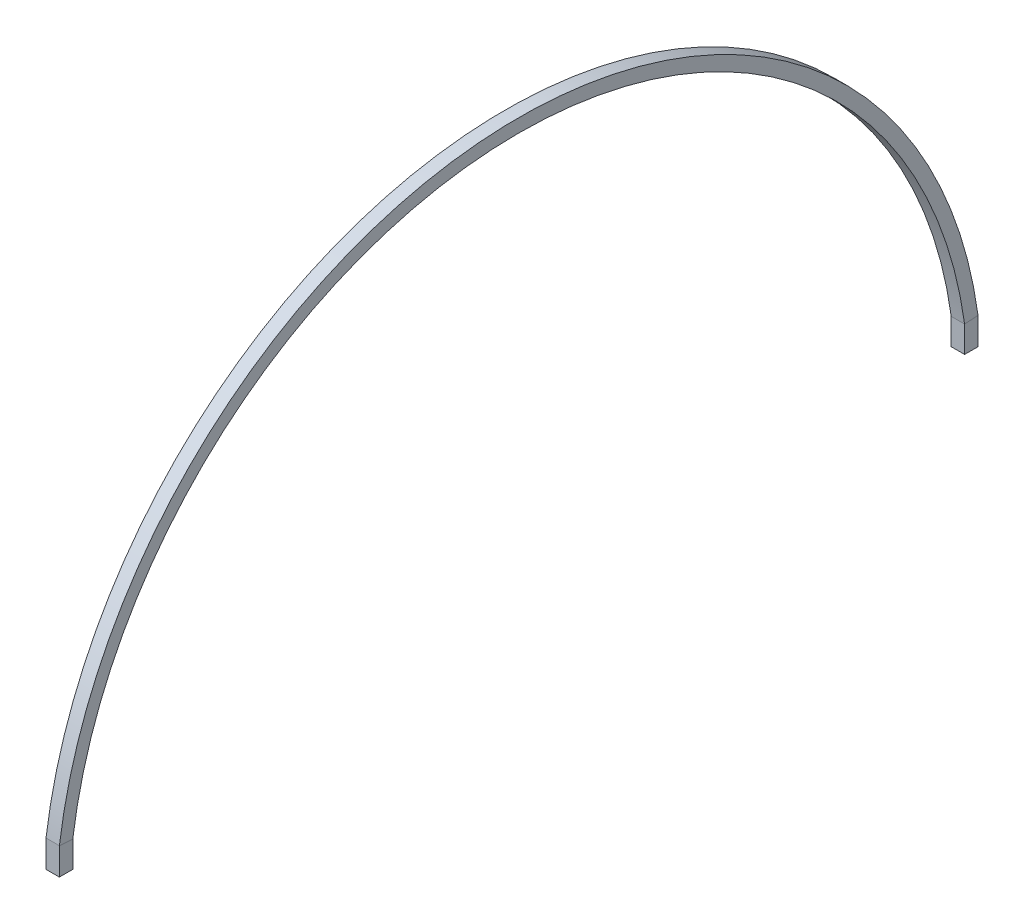
ISO-10303-21;
HEADER;
FILE_DESCRIPTION(('STEP AP214'),'2;1');
FILE_NAME('part.step','',(''),(''),'','','');
FILE_SCHEMA(('AUTOMOTIVE_DESIGN { 1 0 10303 214 1 1 1 1 }'));
ENDSEC;
DATA;
#1=APPLICATION_CONTEXT('core data for automotive mechanical design processes');
#2=APPLICATION_PROTOCOL_DEFINITION('international standard','automotive_design',2000,#1);
#3=PRODUCT_CONTEXT('',#1,'mechanical');
#4=PRODUCT('Part','Part','',(#3));
#5=PRODUCT_RELATED_PRODUCT_CATEGORY('part','',(#4));
#6=PRODUCT_DEFINITION_FORMATION('','',#4);
#7=PRODUCT_DEFINITION_CONTEXT('part definition',#1,'design');
#8=PRODUCT_DEFINITION('design','',#6,#7);
#9=PRODUCT_DEFINITION_SHAPE('','',#8);
#10=(LENGTH_UNIT() NAMED_UNIT(*) SI_UNIT(.MILLI.,.METRE.));
#11=(NAMED_UNIT(*) PLANE_ANGLE_UNIT() SI_UNIT($,.RADIAN.));
#12=(NAMED_UNIT(*) SI_UNIT($,.STERADIAN.) SOLID_ANGLE_UNIT());
#13=UNCERTAINTY_MEASURE_WITH_UNIT(LENGTH_MEASURE(1.E-05),#10,'distance_accuracy_value','');
#14=(GEOMETRIC_REPRESENTATION_CONTEXT(3) GLOBAL_UNCERTAINTY_ASSIGNED_CONTEXT((#13)) GLOBAL_UNIT_ASSIGNED_CONTEXT((#10,
#11,#12)) REPRESENTATION_CONTEXT('',''));
#15=CARTESIAN_POINT('',(0.,0.,0.));
#16=DIRECTION('',(0.,0.,1.));
#17=DIRECTION('',(1.,0.,0.));
#18=AXIS2_PLACEMENT_3D('',#15,#16,#17);
#19=CARTESIAN_POINT('',(-13.0000000000001,1.07842105263029,0.));
#20=DIRECTION('',(-1.,0.,0.));
#21=DIRECTION('',(0.,0.,1.));
#22=AXIS2_PLACEMENT_3D('',#19,#20,#21);
#23=PLANE('',#22);
#24=DIRECTION('',(0.,0.0683704216386458,0.997660004934022));
#25=VECTOR('',#24,1.);
#26=CARTESIAN_POINT('',(-13.0000000000003,-0.892326633343182,1002.));
#27=LINE('',#26,#25);
#28=CARTESIAN_POINT('',(-13.,-0.892326633343182,1002.));
#29=VERTEX_POINT('',#28);
#30=CARTESIAN_POINT('',(-13.,0.889473733100005,1027.99999999833));
#31=VERTEX_POINT('',#30);
#32=EDGE_CURVE('E161',#29,#31,#27,.T.);
#33=ORIENTED_EDGE('',*,*,#32,.T.);
#34=DIRECTION('',(0.,-1.,0.));
#35=VECTOR('',#34,1.);
#36=CARTESIAN_POINT('',(-13.,1.07842105263029,1028.));
#37=LINE('',#36,#35);
#38=CARTESIAN_POINT('',(-13.,-60.,1028.));
#39=VERTEX_POINT('',#38);
#40=EDGE_CURVE('E229',#31,#39,#37,.T.);
#41=ORIENTED_EDGE('',*,*,#40,.T.);
#42=DIRECTION('',(0.,0.,1.));
#43=VECTOR('',#42,1.);
#44=CARTESIAN_POINT('',(-13.0000000000001,-60.,0.));
#45=LINE('',#44,#43);
#46=CARTESIAN_POINT('',(-13.,-60.,1002.));
#47=VERTEX_POINT('',#46);
#48=EDGE_CURVE('E234',#47,#39,#45,.T.);
#49=ORIENTED_EDGE('',*,*,#48,.F.);
#50=DIRECTION('',(0.,-1.,0.));
#51=VECTOR('',#50,1.);
#52=CARTESIAN_POINT('',(-13.,1.07842105263029,1002.));
#53=LINE('',#52,#51);
#54=EDGE_CURVE('E189',#29,#47,#53,.T.);
#55=ORIENTED_EDGE('',*,*,#54,.F.);
#56=EDGE_LOOP('',(#33,#41,#49,#55));
#57=FACE_BOUND('',#56,.T.);
#58=ADVANCED_FACE('F40',(#57),#23,.F.);
#59=CARTESIAN_POINT('',(0.,1.07842105263029,1002.));
#60=DIRECTION('',(0.,0.,-1.));
#61=DIRECTION('',(-1.,0.,0.));
#62=AXIS2_PLACEMENT_3D('',#59,#60,#61);
#63=PLANE('',#62);
#64=ORIENTED_EDGE('',*,*,#54,.T.);
#65=DIRECTION('',(1.,0.,0.));
#66=VECTOR('',#65,1.);
#67=CARTESIAN_POINT('',(0.,-60.,1002.));
#68=LINE('',#67,#66);
#69=CARTESIAN_POINT('',(12.9999999999999,-60.,1002.));
#70=VERTEX_POINT('',#69);
#71=EDGE_CURVE('E185',#47,#70,#68,.T.);
#72=ORIENTED_EDGE('',*,*,#71,.T.);
#73=DIRECTION('',(0.,-1.,0.));
#74=VECTOR('',#73,1.);
#75=CARTESIAN_POINT('',(12.9999999999999,1.07842105263029,1002.));
#76=LINE('',#75,#74);
#77=CARTESIAN_POINT('',(12.9999999999999,-0.892326633343182,1002.));
#78=VERTEX_POINT('',#77);
#79=EDGE_CURVE('E44',#78,#70,#76,.T.);
#80=ORIENTED_EDGE('',*,*,#79,.F.);
#81=DIRECTION('',(1.,0.,0.));
#82=VECTOR('',#81,1.);
#83=CARTESIAN_POINT('',(0.,-0.892326633343182,1002.));
#84=LINE('',#83,#82);
#85=EDGE_CURVE('E168',#29,#78,#84,.T.);
#86=ORIENTED_EDGE('',*,*,#85,.F.);
#87=EDGE_LOOP('',(#64,#72,#80,#86));
#88=FACE_BOUND('',#87,.T.);
#89=ADVANCED_FACE('F184',(#88),#63,.F.);
#90=CARTESIAN_POINT('',(12.9999999999999,1.07842105263029,0.));
#91=DIRECTION('',(1.,0.,0.));
#92=DIRECTION('',(0.,0.,-1.));
#93=AXIS2_PLACEMENT_3D('',#90,#91,#92);
#94=PLANE('',#93);
#95=DIRECTION('',(0.,-0.0683704216386464,-0.997660004934022));
#96=VECTOR('',#95,1.);
#97=CARTESIAN_POINT('',(12.9999999999997,0.889473733100017,1027.99999999667));
#98=LINE('',#97,#96);
#99=CARTESIAN_POINT('',(13.,0.889473733100013,1027.99999999834));
#100=VERTEX_POINT('',#99);
#101=EDGE_CURVE('E178',#100,#78,#98,.T.);
#102=ORIENTED_EDGE('',*,*,#101,.T.);
#103=ORIENTED_EDGE('',*,*,#79,.T.);
#104=DIRECTION('',(0.,0.,1.));
#105=VECTOR('',#104,1.);
#106=CARTESIAN_POINT('',(12.9999999999999,-60.,0.));
#107=LINE('',#106,#105);
#108=CARTESIAN_POINT('',(13.,-60.,1028.));
#109=VERTEX_POINT('',#108);
#110=EDGE_CURVE('E240',#70,#109,#107,.T.);
#111=ORIENTED_EDGE('',*,*,#110,.T.);
#112=DIRECTION('',(0.,-1.,0.));
#113=VECTOR('',#112,1.);
#114=CARTESIAN_POINT('',(13.,1.07842105263029,1028.));
#115=LINE('',#114,#113);
#116=EDGE_CURVE('E192',#100,#109,#115,.T.);
#117=ORIENTED_EDGE('',*,*,#116,.F.);
#118=EDGE_LOOP('',(#102,#103,#111,#117));
#119=FACE_BOUND('',#118,.T.);
#120=ADVANCED_FACE('F42',(#119),#94,.F.);
#121=CARTESIAN_POINT('',(0.,1.07842105263029,1028.));
#122=DIRECTION('',(0.,0.,1.));
#123=DIRECTION('',(1.,0.,0.));
#124=AXIS2_PLACEMENT_3D('',#121,#122,#123);
#125=PLANE('',#124);
#126=DIRECTION('',(-1.,0.,0.));
#127=VECTOR('',#126,1.);
#128=CARTESIAN_POINT('',(0.,0.889473733557763,1028.));
#129=LINE('',#128,#127);
#130=EDGE_CURVE('E179',#31,#100,#129,.F.);
#131=ORIENTED_EDGE('',*,*,#130,.T.);
#132=ORIENTED_EDGE('',*,*,#116,.T.);
#133=DIRECTION('',(1.,0.,0.));
#134=VECTOR('',#133,1.);
#135=CARTESIAN_POINT('',(0.,-60.,1028.));
#136=LINE('',#135,#134);
#137=EDGE_CURVE('E238',#39,#109,#136,.T.);
#138=ORIENTED_EDGE('',*,*,#137,.F.);
#139=ORIENTED_EDGE('',*,*,#40,.F.);
#140=EDGE_LOOP('',(#131,#132,#138,#139));
#141=FACE_BOUND('',#140,.T.);
#142=ADVANCED_FACE('F321',(#141),#125,.F.);
#143=CARTESIAN_POINT('',(0.,-139.54802259887,-1.11022302462516E-13));
#144=DIRECTION('',(1.,0.,0.));
#145=DIRECTION('',(0.,0.,-1.));
#146=AXIS2_PLACEMENT_3D('',#143,#144,#145);
#147=CYLINDRICAL_SURFACE('',#146,1011.54802259887);
#148=ORIENTED_EDGE('',*,*,#85,.T.);
#149=CARTESIAN_POINT('',(12.9999999999999,-139.54802259887,-1.11022302462516E-13));
#150=DIRECTION('',(1.,0.,0.));
#151=DIRECTION('',(0.,0.136204472138742,-0.990680746643139));
#152=AXIS2_PLACEMENT_3D('',#149,#150,#151);
#153=CIRCLE('',#152,1011.54802259887);
#154=CARTESIAN_POINT('',(12.9999999999999,-0.89232663333999,-1002.));
#155=VERTEX_POINT('',#154);
#156=EDGE_CURVE('E173',#155,#78,#153,.T.);
#157=ORIENTED_EDGE('',*,*,#156,.F.);
#158=DIRECTION('',(1.,0.,0.));
#159=VECTOR('',#158,1.);
#160=CARTESIAN_POINT('',(0.,-0.89232663333999,-1002.));
#161=LINE('',#160,#159);
#162=CARTESIAN_POINT('',(-13.,-0.89232663333999,-1002.));
#163=VERTEX_POINT('',#162);
#164=EDGE_CURVE('E258',#163,#155,#161,.T.);
#165=ORIENTED_EDGE('',*,*,#164,.F.);
#166=CARTESIAN_POINT('',(-13.,-139.54802259887,-1.11022302462516E-13));
#167=DIRECTION('',(1.,0.,0.));
#168=DIRECTION('',(0.,0.136204472138742,-0.990680746643139));
#169=AXIS2_PLACEMENT_3D('',#166,#167,#168);
#170=CIRCLE('',#169,1011.54802259887);
#171=EDGE_CURVE('E175',#163,#29,#170,.T.);
#172=ORIENTED_EDGE('',*,*,#171,.T.);
#173=EDGE_LOOP('',(#148,#157,#165,#172));
#174=FACE_BOUND('',#173,.T.);
#175=ADVANCED_FACE('F170',(#174),#147,.T.);
#176=CARTESIAN_POINT('',(13.,0.702287164188714,-1028.02573547658));
#177=CARTESIAN_POINT('',(13.,1.06010770561768,-1027.97654025581));
#178=CARTESIAN_POINT('',(13.,1.41227515065792,-1027.92812234497));
#179=CARTESIAN_POINT('',(13.,3.67811436755165,-1027.61660120449));
#180=CARTESIAN_POINT('',(13.,5.60887975086146,-1027.34567061837));
#181=CARTESIAN_POINT('',(13.,9.44481836487751,-1026.79637055208));
#182=CARTESIAN_POINT('',(13.,11.362016770412,-1026.51634825997));
#183=CARTESIAN_POINT('',(13.,17.111210067065,-1025.66017770501));
#184=CARTESIAN_POINT('',(13.,20.9408030600636,-1025.06792559827));
#185=CARTESIAN_POINT('',(13.,32.4192597341004,-1023.22686497892));
#186=CARTESIAN_POINT('',(13.,40.0578012300402,-1021.91374942824));
#187=CARTESIAN_POINT('',(13.,62.9264102432095,-1017.71816302121));
#188=CARTESIAN_POINT('',(13.,78.1094562823739,-1014.57940879503));
#189=CARTESIAN_POINT('',(13.,123.424759267774,-1004.14751799048));
#190=CARTESIAN_POINT('',(13.,153.322845625887,-995.83812745659));
#191=CARTESIAN_POINT('',(13.,241.721967702922,-966.945284438361));
#192=CARTESIAN_POINT('',(13.,298.92254507369,-942.387154991024));
#193=CARTESIAN_POINT('',(13.,408.029862408457,-883.463891990328));
#194=CARTESIAN_POINT('',(13.,459.934727079541,-849.09977119274));
#195=CARTESIAN_POINT('',(13.,556.786749743985,-771.665648730194));
#196=CARTESIAN_POINT('',(13.,601.732243088672,-728.596977962863));
#197=CARTESIAN_POINT('',(13.,683.224662833493,-635.133920304247));
#198=CARTESIAN_POINT('',(13.,719.770188528913,-584.741139850137));
#199=CARTESIAN_POINT('',(13.,783.291004191017,-478.244831897825));
#200=CARTESIAN_POINT('',(13.,810.265202326405,-422.143134924156));
#201=CARTESIAN_POINT('',(13.,853.778439958984,-306.027004345003));
#202=CARTESIAN_POINT('',(13.,870.316731537883,-246.014566601368));
#203=CARTESIAN_POINT('',(13.,892.427701553305,-124.000376361944));
#204=CARTESIAN_POINT('',(13.,898.,-62.0007210182265));
#205=CARTESIAN_POINT('',(13.,898.,62.0007210182268));
#206=CARTESIAN_POINT('',(13.,892.427701565096,124.000376344708));
#207=CARTESIAN_POINT('',(13.,870.316731526092,246.014566618605));
#208=CARTESIAN_POINT('',(13.,853.778439955434,306.027004354474));
#209=CARTESIAN_POINT('',(13.,810.265202329954,422.143134914685));
#210=CARTESIAN_POINT('',(13.,783.291004185836,478.244831903113));
#211=CARTESIAN_POINT('',(13.,719.770188534094,584.741139844849));
#212=CARTESIAN_POINT('',(13.,683.224662830244,635.133920294877));
#213=CARTESIAN_POINT('',(13.,601.73224309192,728.596977972232));
#214=CARTESIAN_POINT('',(13.,556.786749759875,771.665648716119));
#215=CARTESIAN_POINT('',(13.,459.93472706365,849.099771206816));
#216=CARTESIAN_POINT('',(13.,408.029862393872,883.46389200473));
#217=CARTESIAN_POINT('',(13.,298.922545088273,942.387154976623));
#218=CARTESIAN_POINT('',(13.,241.721967684915,966.945284444313));
#219=CARTESIAN_POINT('',(13.,153.322845634891,995.838127453614));
#220=CARTESIAN_POINT('',(13.,123.424759267779,1004.14751798407));
#221=CARTESIAN_POINT('',(13.,78.1094562823712,1014.57940879824));
#222=CARTESIAN_POINT('',(13.,62.9264102443576,1017.71816302096));
#223=CARTESIAN_POINT('',(13.,40.0578012294668,1021.91374942836));
#224=CARTESIAN_POINT('',(13.,32.4192597337226,1023.22686497894));
#225=CARTESIAN_POINT('',(13.,20.9408030602531,1025.06792559826));
#226=CARTESIAN_POINT('',(13.,17.1112100666136,1025.66017770635));
#227=CARTESIAN_POINT('',(13.,11.3620167706383,1026.5163482593));
#228=CARTESIAN_POINT('',(13.,9.44481836548402,1026.79637055191));
#229=CARTESIAN_POINT('',(13.,5.60887975025488,1027.34567061854));
#230=CARTESIAN_POINT('',(13.,3.67811436809074,1027.61660120429));
#231=CARTESIAN_POINT('',(13.,1.41227515055514,1027.92812234501));
#232=CARTESIAN_POINT('',(13.,1.060107705703,1027.97654025588));
#233=CARTESIAN_POINT('',(13.,0.702287164185605,1028.02573547658));
#234=CARTESIAN_POINT('',(-13.,0.702287164188714,-1028.02573547658));
#235=CARTESIAN_POINT('',(-13.,1.06010770561768,-1027.97654025581));
#236=CARTESIAN_POINT('',(-13.,1.41227515065792,-1027.92812234497));
#237=CARTESIAN_POINT('',(-13.,3.67811436755165,-1027.61660120449));
#238=CARTESIAN_POINT('',(-13.,5.60887975086146,-1027.34567061837));
#239=CARTESIAN_POINT('',(-13.,9.44481836487751,-1026.79637055208));
#240=CARTESIAN_POINT('',(-13.,11.362016770412,-1026.51634825997));
#241=CARTESIAN_POINT('',(-13.,17.111210067065,-1025.66017770501));
#242=CARTESIAN_POINT('',(-13.,20.9408030600636,-1025.06792559827));
#243=CARTESIAN_POINT('',(-13.,32.4192597341004,-1023.22686497892));
#244=CARTESIAN_POINT('',(-13.,40.0578012300402,-1021.91374942824));
#245=CARTESIAN_POINT('',(-13.,62.9264102432095,-1017.71816302121));
#246=CARTESIAN_POINT('',(-13.,78.1094562823739,-1014.57940879503));
#247=CARTESIAN_POINT('',(-13.,123.424759267774,-1004.14751799048));
#248=CARTESIAN_POINT('',(-13.,153.322845625887,-995.83812745659));
#249=CARTESIAN_POINT('',(-13.,241.721967702922,-966.945284438361));
#250=CARTESIAN_POINT('',(-13.,298.92254507369,-942.387154991024));
#251=CARTESIAN_POINT('',(-13.,408.029862408457,-883.463891990328));
#252=CARTESIAN_POINT('',(-13.,459.934727079541,-849.09977119274));
#253=CARTESIAN_POINT('',(-13.,556.786749743985,-771.665648730194));
#254=CARTESIAN_POINT('',(-13.,601.732243088672,-728.596977962863));
#255=CARTESIAN_POINT('',(-13.,683.224662833493,-635.133920304247));
#256=CARTESIAN_POINT('',(-13.,719.770188528913,-584.741139850137));
#257=CARTESIAN_POINT('',(-13.,783.291004191017,-478.244831897825));
#258=CARTESIAN_POINT('',(-13.,810.265202326405,-422.143134924156));
#259=CARTESIAN_POINT('',(-13.,853.778439958984,-306.027004345003));
#260=CARTESIAN_POINT('',(-13.,870.316731537883,-246.014566601368));
#261=CARTESIAN_POINT('',(-13.,892.427701553305,-124.000376361944));
#262=CARTESIAN_POINT('',(-13.,898.,-62.0007210182265));
#263=CARTESIAN_POINT('',(-13.,898.,62.0007210182268));
#264=CARTESIAN_POINT('',(-13.,892.427701565096,124.000376344708));
#265=CARTESIAN_POINT('',(-13.,870.316731526092,246.014566618605));
#266=CARTESIAN_POINT('',(-13.,853.778439955434,306.027004354474));
#267=CARTESIAN_POINT('',(-13.,810.265202329954,422.143134914685));
#268=CARTESIAN_POINT('',(-13.,783.291004185836,478.244831903113));
#269=CARTESIAN_POINT('',(-13.,719.770188534094,584.741139844849));
#270=CARTESIAN_POINT('',(-13.,683.224662830244,635.133920294877));
#271=CARTESIAN_POINT('',(-13.,601.73224309192,728.596977972232));
#272=CARTESIAN_POINT('',(-13.,556.786749759875,771.665648716119));
#273=CARTESIAN_POINT('',(-13.,459.93472706365,849.099771206816));
#274=CARTESIAN_POINT('',(-13.,408.029862393872,883.46389200473));
#275=CARTESIAN_POINT('',(-13.,298.922545088273,942.387154976623));
#276=CARTESIAN_POINT('',(-13.,241.721967684915,966.945284444313));
#277=CARTESIAN_POINT('',(-13.,153.322845634891,995.838127453614));
#278=CARTESIAN_POINT('',(-13.,123.424759267779,1004.14751798407));
#279=CARTESIAN_POINT('',(-13.,78.1094562823712,1014.57940879824));
#280=CARTESIAN_POINT('',(-13.,62.9264102443576,1017.71816302096));
#281=CARTESIAN_POINT('',(-13.,40.0578012294668,1021.91374942836));
#282=CARTESIAN_POINT('',(-13.,32.4192597337226,1023.22686497894));
#283=CARTESIAN_POINT('',(-13.,20.9408030602531,1025.06792559826));
#284=CARTESIAN_POINT('',(-13.,17.1112100666136,1025.66017770635));
#285=CARTESIAN_POINT('',(-13.,11.3620167706383,1026.5163482593));
#286=CARTESIAN_POINT('',(-13.,9.44481836548402,1026.79637055191));
#287=CARTESIAN_POINT('',(-13.,5.60887975025488,1027.34567061854));
#288=CARTESIAN_POINT('',(-13.,3.67811436809074,1027.61660120429));
#289=CARTESIAN_POINT('',(-13.,1.41227515055514,1027.92812234501));
#290=CARTESIAN_POINT('',(-13.,1.060107705703,1027.97654025588));
#291=CARTESIAN_POINT('',(-13.,0.702287164185605,1028.02573547658));
#292=B_SPLINE_SURFACE_WITH_KNOTS('',1,3,((#176,#177,#178,#179,#180,#181,#182,#183,#184,#185,
#186,#187,#188,#189,#190,#191,#192,#193,#194,#195,#196,#197,#198,#199,#200,#201,#202,#203,#204,
#205,#206,#207,#208,#209,#210,#211,#212,#213,#214,#215,#216,#217,#218,#219,#220,#221,#222,#223,
#224,#225,#226,#227,#228,#229,#230,#231,#232,#233),(#234,#235,#236,#237,#238,#239,#240,#241,
#242,#243,#244,#245,#246,#247,#248,#249,#250,#251,#252,#253,#254,#255,#256,#257,#258,#259,#260,
#261,#262,#263,#264,#265,#266,#267,#268,#269,#270,#271,#272,#273,#274,#275,#276,#277,#278,#279,
#280,#281,#282,#283,#284,#285,#286,#287,#288,#289,#290,#291)),.UNSPECIFIED.,.F.,.F.,.F.,(2,2),
(4,2,2,2,2,2,2,2,2,2,2,2,2,2,2,2,2,2,2,2,2,2,2,2,2,2,2,2,4),(0.,1.),(-0.00036696347777407,0.,
0.001953125,0.00390625,0.0078125,0.015625,0.03125,0.0625,0.125,0.1875,0.25,0.3125,0.375,0.4375,
0.5,0.5625,0.625,0.6875,0.75,0.8125,0.875,0.9375,0.96875,0.984375,0.9921875,0.99609375,
0.998046875,1.,1.00036696347777),.UNSPECIFIED.);
#293=DIRECTION('',(0.,-0.990680746643139,0.136204472138741));
#294=VECTOR('',#293,1.);
#295=CARTESIAN_POINT('',(-13.,1.77065813780361,1027.87884970636));
#296=LINE('',#295,#294);
#297=CARTESIAN_POINT('',(-13.0000000000001,1.77065813780373,1027.87884970636));
#298=VERTEX_POINT('',#297);
#299=EDGE_CURVE('E203',#298,#31,#296,.T.);
#300=CARTESIAN_POINT('',(-13.,-139.54802259887,-1.11022302462516E-13));
#301=DIRECTION('',(1.,0.,0.));
#302=DIRECTION('',(0.,0.136204472138741,-0.990680746643139));
#303=AXIS2_PLACEMENT_3D('',#300,#301,#302);
#304=CIRCLE('',#303,1037.54802259887);
#305=CARTESIAN_POINT('',(-13.,1.77065813780413,-1027.87884970636));
#306=VERTEX_POINT('',#305);
#307=EDGE_CURVE('E205',#306,#298,#304,.T.);
#308=DIRECTION('',(0.,0.990680746643139,0.136204472138741));
#309=VECTOR('',#308,1.);
#310=CARTESIAN_POINT('',(-13.,0.702287164188686,-1028.02573547658));
#311=LINE('',#310,#309);
#312=CARTESIAN_POINT('',(-13.,0.889473732875672,-1027.99999999834));
#313=VERTEX_POINT('',#312);
#314=EDGE_CURVE('E223',#313,#306,#311,.T.);
#315=DIRECTION('',(-1.,0.,0.));
#316=VECTOR('',#315,1.);
#317=CARTESIAN_POINT('',(0.,0.88947373333132,-1028.));
#318=LINE('',#317,#316);
#319=CARTESIAN_POINT('',(13.,0.889473732875672,-1027.99999999834));
#320=VERTEX_POINT('',#319);
#321=EDGE_CURVE('E260',#313,#320,#318,.F.);
#322=DIRECTION('',(0.,0.990680746643139,0.136204472138741));
#323=VECTOR('',#322,1.);
#324=CARTESIAN_POINT('',(13.,0.702287164188714,-1028.02573547658));
#325=LINE('',#324,#323);
#326=CARTESIAN_POINT('',(13.,1.77065813780416,-1027.87884970636));
#327=VERTEX_POINT('',#326);
#328=EDGE_CURVE('E188',#320,#327,#325,.T.);
#329=CARTESIAN_POINT('',(13.,-139.54802259887,-1.11022302462516E-13));
#330=DIRECTION('',(1.,0.,0.));
#331=DIRECTION('',(0.,0.136204472138742,-0.990680746643139));
#332=AXIS2_PLACEMENT_3D('',#329,#330,#331);
#333=CIRCLE('',#332,1037.54802259887);
#334=CARTESIAN_POINT('',(12.9999999999999,1.77065813780373,1027.87884970636));
#335=VERTEX_POINT('',#334);
#336=EDGE_CURVE('E216',#327,#335,#333,.T.);
#337=DIRECTION('',(0.,-0.990680746643139,0.136204472138741));
#338=VECTOR('',#337,1.);
#339=CARTESIAN_POINT('',(13.,1.77065813780364,1027.87884970636));
#340=LINE('',#339,#338);
#341=EDGE_CURVE('E200',#335,#100,#340,.T.);
#342=ORIENTED_EDGE('',*,*,#299,.F.);
#343=ORIENTED_EDGE('',*,*,#307,.F.);
#344=ORIENTED_EDGE('',*,*,#314,.F.);
#345=ORIENTED_EDGE('',*,*,#321,.T.);
#346=ORIENTED_EDGE('',*,*,#328,.T.);
#347=ORIENTED_EDGE('',*,*,#336,.T.);
#348=ORIENTED_EDGE('',*,*,#341,.T.);
#349=ORIENTED_EDGE('',*,*,#130,.F.);
#350=EDGE_LOOP('',(#342,#343,#344,#345,#346,#347,#348,#349));
#351=FACE_BOUND('',#350,.T.);
#352=ADVANCED_FACE('F272',(#351),#292,.F.);
#353=CARTESIAN_POINT('',(12.9999999999999,-139.315910194437,-9.60592792743092));
#354=DIRECTION('',(1.,0.,0.));
#355=DIRECTION('',(0.,0.,-1.));
#356=AXIS2_PLACEMENT_3D('',#353,#354,#355);
#357=PLANE('',#356);
#358=ORIENTED_EDGE('',*,*,#341,.F.);
#359=ORIENTED_EDGE('',*,*,#336,.F.);
#360=ORIENTED_EDGE('',*,*,#328,.F.);
#361=DIRECTION('',(0.,0.0683704216212417,-0.997660004935215));
#362=VECTOR('',#361,1.);
#363=CARTESIAN_POINT('',(13.,-0.89232663333999,-1002.));
#364=LINE('',#363,#362);
#365=EDGE_CURVE('E198',#155,#320,#364,.T.);
#366=ORIENTED_EDGE('',*,*,#365,.F.);
#367=ORIENTED_EDGE('',*,*,#156,.T.);
#368=ORIENTED_EDGE('',*,*,#101,.F.);
#369=EDGE_LOOP('',(#358,#359,#360,#366,#367,#368));
#370=FACE_BOUND('',#369,.T.);
#371=ADVANCED_FACE('F196',(#370),#357,.F.);
#372=CARTESIAN_POINT('',(-13.0000000000001,-139.315910194437,-9.60592792743092));
#373=DIRECTION('',(-1.,0.,0.));
#374=DIRECTION('',(0.,0.,1.));
#375=AXIS2_PLACEMENT_3D('',#372,#373,#374);
#376=PLANE('',#375);
#377=ORIENTED_EDGE('',*,*,#171,.F.);
#378=DIRECTION('',(0.,0.0683704216212423,-0.997660004935215));
#379=VECTOR('',#378,1.);
#380=CARTESIAN_POINT('',(-13.,-0.89232663333999,-1002.));
#381=LINE('',#380,#379);
#382=EDGE_CURVE('E242',#163,#313,#381,.T.);
#383=ORIENTED_EDGE('',*,*,#382,.T.);
#384=ORIENTED_EDGE('',*,*,#314,.T.);
#385=ORIENTED_EDGE('',*,*,#307,.T.);
#386=ORIENTED_EDGE('',*,*,#299,.T.);
#387=ORIENTED_EDGE('',*,*,#32,.F.);
#388=EDGE_LOOP('',(#377,#383,#384,#385,#386,#387));
#389=FACE_BOUND('',#388,.T.);
#390=ADVANCED_FACE('F287',(#389),#376,.F.);
#391=CARTESIAN_POINT('',(0.,-59.9999999999996,-1002.));
#392=DIRECTION('',(0.,0.,1.));
#393=DIRECTION('',(1.,0.,0.));
#394=AXIS2_PLACEMENT_3D('',#391,#392,#393);
#395=PLANE('',#394);
#396=ORIENTED_EDGE('',*,*,#164,.T.);
#397=DIRECTION('',(0.,1.,0.));
#398=VECTOR('',#397,1.);
#399=CARTESIAN_POINT('',(12.9999999999999,-59.9999999999996,-1002.));
#400=LINE('',#399,#398);
#401=CARTESIAN_POINT('',(12.9999999999999,-59.9999999999996,-1002.));
#402=VERTEX_POINT('',#401);
#403=EDGE_CURVE('E256',#402,#155,#400,.T.);
#404=ORIENTED_EDGE('',*,*,#403,.F.);
#405=DIRECTION('',(1.,0.,0.));
#406=VECTOR('',#405,1.);
#407=CARTESIAN_POINT('',(0.,-59.9999999999996,-1002.));
#408=LINE('',#407,#406);
#409=CARTESIAN_POINT('',(-13.,-59.9999999999996,-1002.));
#410=VERTEX_POINT('',#409);
#411=EDGE_CURVE('E455',#410,#402,#408,.T.);
#412=ORIENTED_EDGE('',*,*,#411,.F.);
#413=DIRECTION('',(0.,1.,0.));
#414=VECTOR('',#413,1.);
#415=CARTESIAN_POINT('',(-13.,-59.9999999999996,-1002.));
#416=LINE('',#415,#414);
#417=EDGE_CURVE('E251',#410,#163,#416,.T.);
#418=ORIENTED_EDGE('',*,*,#417,.T.);
#419=EDGE_LOOP('',(#396,#404,#412,#418));
#420=FACE_BOUND('',#419,.T.);
#421=ADVANCED_FACE('F443',(#420),#395,.F.);
#422=CARTESIAN_POINT('',(12.9999999999999,-59.9999999999996,0.));
#423=DIRECTION('',(1.,0.,0.));
#424=DIRECTION('',(0.,0.,-1.));
#425=AXIS2_PLACEMENT_3D('',#422,#423,#424);
#426=PLANE('',#425);
#427=ORIENTED_EDGE('',*,*,#365,.T.);
#428=DIRECTION('',(0.,1.,0.));
#429=VECTOR('',#428,1.);
#430=CARTESIAN_POINT('',(13.,-59.9999999999996,-1028.));
#431=LINE('',#430,#429);
#432=CARTESIAN_POINT('',(13.,-59.9999999999996,-1028.));
#433=VERTEX_POINT('',#432);
#434=EDGE_CURVE('E228',#433,#320,#431,.T.);
#435=ORIENTED_EDGE('',*,*,#434,.F.);
#436=DIRECTION('',(0.,0.,-1.));
#437=VECTOR('',#436,1.);
#438=CARTESIAN_POINT('',(12.9999999999999,-59.9999999999996,0.));
#439=LINE('',#438,#437);
#440=EDGE_CURVE('E480',#402,#433,#439,.T.);
#441=ORIENTED_EDGE('',*,*,#440,.F.);
#442=ORIENTED_EDGE('',*,*,#403,.T.);
#443=EDGE_LOOP('',(#427,#435,#441,#442));
#444=FACE_BOUND('',#443,.T.);
#445=ADVANCED_FACE('F285',(#444),#426,.F.);
#446=CARTESIAN_POINT('',(0.,-59.9999999999996,-1028.));
#447=DIRECTION('',(0.,0.,-1.));
#448=DIRECTION('',(-1.,0.,0.));
#449=AXIS2_PLACEMENT_3D('',#446,#447,#448);
#450=PLANE('',#449);
#451=DIRECTION('',(0.,1.,0.));
#452=VECTOR('',#451,1.);
#453=CARTESIAN_POINT('',(-13.,-59.9999999999996,-1028.));
#454=LINE('',#453,#452);
#455=CARTESIAN_POINT('',(-13.,-59.9999999999996,-1028.));
#456=VERTEX_POINT('',#455);
#457=EDGE_CURVE('E248',#456,#313,#454,.T.);
#458=ORIENTED_EDGE('',*,*,#457,.F.);
#459=DIRECTION('',(1.,0.,0.));
#460=VECTOR('',#459,1.);
#461=CARTESIAN_POINT('',(0.,-59.9999999999996,-1028.));
#462=LINE('',#461,#460);
#463=EDGE_CURVE('E247',#456,#433,#462,.T.);
#464=ORIENTED_EDGE('',*,*,#463,.T.);
#465=ORIENTED_EDGE('',*,*,#434,.T.);
#466=ORIENTED_EDGE('',*,*,#321,.F.);
#467=EDGE_LOOP('',(#458,#464,#465,#466));
#468=FACE_BOUND('',#467,.T.);
#469=ADVANCED_FACE('F437',(#468),#450,.F.);
#470=CARTESIAN_POINT('',(-13.0000000000001,-59.9999999999996,0.));
#471=DIRECTION('',(-1.,0.,0.));
#472=DIRECTION('',(0.,0.,1.));
#473=AXIS2_PLACEMENT_3D('',#470,#471,#472);
#474=PLANE('',#473);
#475=ORIENTED_EDGE('',*,*,#417,.F.);
#476=DIRECTION('',(0.,0.,-1.));
#477=VECTOR('',#476,1.);
#478=CARTESIAN_POINT('',(-13.0000000000001,-59.9999999999996,0.));
#479=LINE('',#478,#477);
#480=EDGE_CURVE('E457',#410,#456,#479,.T.);
#481=ORIENTED_EDGE('',*,*,#480,.T.);
#482=ORIENTED_EDGE('',*,*,#457,.T.);
#483=ORIENTED_EDGE('',*,*,#382,.F.);
#484=EDGE_LOOP('',(#475,#481,#482,#483));
#485=FACE_BOUND('',#484,.T.);
#486=ADVANCED_FACE('F436',(#485),#474,.F.);
#487=CARTESIAN_POINT('',(0.,-60.,0.));
#488=DIRECTION('',(0.,1.,0.));
#489=DIRECTION('',(0.,0.,1.));
#490=AXIS2_PLACEMENT_3D('',#487,#488,#489);
#491=PLANE('',#490);
#492=ORIENTED_EDGE('',*,*,#137,.T.);
#493=ORIENTED_EDGE('',*,*,#110,.F.);
#494=ORIENTED_EDGE('',*,*,#71,.F.);
#495=ORIENTED_EDGE('',*,*,#48,.T.);
#496=EDGE_LOOP('',(#492,#493,#494,#495));
#497=FACE_BOUND('',#496,.T.);
#498=DIRECTION('',(1.,0.,0.));
#499=VECTOR('',#498,1.);
#500=CARTESIAN_POINT('',(0.,-60.,1000.));
#501=LINE('',#500,#499);
#502=CARTESIAN_POINT('',(15.,-60.,1000.));
#503=VERTEX_POINT('',#502);
#504=CARTESIAN_POINT('',(-15.,-60.,1000.));
#505=VERTEX_POINT('',#504);
#506=EDGE_CURVE('E464',#503,#505,#501,.F.);
#507=ORIENTED_EDGE('',*,*,#506,.F.);
#508=DIRECTION('',(0.,0.,1.));
#509=VECTOR('',#508,1.);
#510=CARTESIAN_POINT('',(14.9999999999999,-60.,0.));
#511=LINE('',#510,#509);
#512=CARTESIAN_POINT('',(15.,-60.,1030.));
#513=VERTEX_POINT('',#512);
#514=EDGE_CURVE('E467',#513,#503,#511,.F.);
#515=ORIENTED_EDGE('',*,*,#514,.F.);
#516=DIRECTION('',(1.,0.,0.));
#517=VECTOR('',#516,1.);
#518=CARTESIAN_POINT('',(0.,-60.,1030.));
#519=LINE('',#518,#517);
#520=CARTESIAN_POINT('',(-15.,-60.,1030.));
#521=VERTEX_POINT('',#520);
#522=EDGE_CURVE('E486',#521,#513,#519,.T.);
#523=ORIENTED_EDGE('',*,*,#522,.F.);
#524=DIRECTION('',(0.,0.,1.));
#525=VECTOR('',#524,1.);
#526=CARTESIAN_POINT('',(-15.0000000000001,-60.,0.));
#527=LINE('',#526,#525);
#528=EDGE_CURVE('E469',#505,#521,#527,.T.);
#529=ORIENTED_EDGE('',*,*,#528,.F.);
#530=EDGE_LOOP('',(#507,#515,#523,#529));
#531=FACE_BOUND('',#530,.T.);
#532=ADVANCED_FACE('F432',(#497,#531),#491,.F.);
#533=CARTESIAN_POINT('',(0.,-59.9999999999996,0.));
#534=DIRECTION('',(0.,-1.,0.));
#535=DIRECTION('',(0.,0.,-1.));
#536=AXIS2_PLACEMENT_3D('',#533,#534,#535);
#537=PLANE('',#536);
#538=ORIENTED_EDGE('',*,*,#463,.F.);
#539=ORIENTED_EDGE('',*,*,#480,.F.);
#540=ORIENTED_EDGE('',*,*,#411,.T.);
#541=ORIENTED_EDGE('',*,*,#440,.T.);
#542=EDGE_LOOP('',(#538,#539,#540,#541));
#543=FACE_BOUND('',#542,.T.);
#544=DIRECTION('',(1.,0.,0.));
#545=VECTOR('',#544,1.);
#546=CARTESIAN_POINT('',(0.,-59.9999999999996,-1000.));
#547=LINE('',#546,#545);
#548=CARTESIAN_POINT('',(15.,-59.9999999999996,-1000.));
#549=VERTEX_POINT('',#548);
#550=CARTESIAN_POINT('',(-15.,-59.9999999999996,-1000.));
#551=VERTEX_POINT('',#550);
#552=EDGE_CURVE('E503',#549,#551,#547,.F.);
#553=ORIENTED_EDGE('',*,*,#552,.T.);
#554=DIRECTION('',(0.,0.,-1.));
#555=VECTOR('',#554,1.);
#556=CARTESIAN_POINT('',(-15.0000000000001,-59.9999999999996,0.));
#557=LINE('',#556,#555);
#558=CARTESIAN_POINT('',(-15.,-59.9999999999996,-1030.));
#559=VERTEX_POINT('',#558);
#560=EDGE_CURVE('E508',#551,#559,#557,.T.);
#561=ORIENTED_EDGE('',*,*,#560,.T.);
#562=DIRECTION('',(1.,0.,0.));
#563=VECTOR('',#562,1.);
#564=CARTESIAN_POINT('',(0.,-59.9999999999996,-1030.));
#565=LINE('',#564,#563);
#566=CARTESIAN_POINT('',(15.,-59.9999999999996,-1030.));
#567=VERTEX_POINT('',#566);
#568=EDGE_CURVE('E529',#559,#567,#565,.T.);
#569=ORIENTED_EDGE('',*,*,#568,.T.);
#570=DIRECTION('',(0.,0.,-1.));
#571=VECTOR('',#570,1.);
#572=CARTESIAN_POINT('',(14.9999999999999,-59.9999999999996,0.));
#573=LINE('',#572,#571);
#574=EDGE_CURVE('E510',#567,#549,#573,.F.);
#575=ORIENTED_EDGE('',*,*,#574,.T.);
#576=EDGE_LOOP('',(#553,#561,#569,#575));
#577=FACE_BOUND('',#576,.T.);
#578=ADVANCED_FACE('F422',(#543,#577),#537,.T.);
#579=CARTESIAN_POINT('',(-15.0000000000001,1.22894736841976,0.));
#580=DIRECTION('',(1.,0.,0.));
#581=DIRECTION('',(0.,0.,-1.));
#582=AXIS2_PLACEMENT_3D('',#579,#580,#581);
#583=PLANE('',#582);
#584=DIRECTION('',(0.,-0.0683873091518071,-0.997658847475917));
#585=VECTOR('',#584,1.);
#586=CARTESIAN_POINT('',(-15.0000000000002,1.026315839421,1029.9999999966));
#587=LINE('',#586,#585);
#588=CARTESIAN_POINT('',(-15.,1.026315839421,1029.9999999983));
#589=VERTEX_POINT('',#588);
#590=CARTESIAN_POINT('',(-15.,-1.03011785984625,1000.));
#591=VERTEX_POINT('',#590);
#592=EDGE_CURVE('E513',#589,#591,#587,.T.);
#593=ORIENTED_EDGE('',*,*,#592,.T.);
#594=DIRECTION('',(0.,-1.,0.));
#595=VECTOR('',#594,1.);
#596=CARTESIAN_POINT('',(-15.,1.22894736841976,1000.));
#597=LINE('',#596,#595);
#598=EDGE_CURVE('E479',#591,#505,#597,.T.);
#599=ORIENTED_EDGE('',*,*,#598,.T.);
#600=ORIENTED_EDGE('',*,*,#528,.T.);
#601=DIRECTION('',(0.,-1.,0.));
#602=VECTOR('',#601,1.);
#603=CARTESIAN_POINT('',(-15.,1.22894736841976,1030.));
#604=LINE('',#603,#602);
#605=EDGE_CURVE('E482',#589,#521,#604,.T.);
#606=ORIENTED_EDGE('',*,*,#605,.F.);
#607=EDGE_LOOP('',(#593,#599,#600,#606));
#608=FACE_BOUND('',#607,.T.);
#609=ADVANCED_FACE('F418',(#608),#583,.F.);
#610=CARTESIAN_POINT('',(0.,1.22894736841976,1030.));
#611=DIRECTION('',(0.,0.,-1.));
#612=DIRECTION('',(-1.,0.,0.));
#613=AXIS2_PLACEMENT_3D('',#610,#611,#612);
#614=PLANE('',#613);
#615=ORIENTED_EDGE('',*,*,#605,.T.);
#616=ORIENTED_EDGE('',*,*,#522,.T.);
#617=DIRECTION('',(0.,-1.,0.));
#618=VECTOR('',#617,1.);
#619=CARTESIAN_POINT('',(15.,1.22894736841976,1030.));
#620=LINE('',#619,#618);
#621=CARTESIAN_POINT('',(15.,1.026315839421,1029.9999999983));
#622=VERTEX_POINT('',#621);
#623=EDGE_CURVE('E472',#622,#513,#620,.T.);
#624=ORIENTED_EDGE('',*,*,#623,.F.);
#625=DIRECTION('',(1.,0.,0.));
#626=VECTOR('',#625,1.);
#627=CARTESIAN_POINT('',(0.,1.02631583988865,1030.));
#628=LINE('',#627,#626);
#629=EDGE_CURVE('E565',#589,#622,#628,.T.);
#630=ORIENTED_EDGE('',*,*,#629,.F.);
#631=EDGE_LOOP('',(#615,#616,#624,#630));
#632=FACE_BOUND('',#631,.T.);
#633=ADVANCED_FACE('F421',(#632),#614,.F.);
#634=CARTESIAN_POINT('',(14.9999999999999,1.22894736841976,0.));
#635=DIRECTION('',(-1.,0.,0.));
#636=DIRECTION('',(0.,0.,1.));
#637=AXIS2_PLACEMENT_3D('',#634,#635,#636);
#638=PLANE('',#637);
#639=DIRECTION('',(0.,0.0683873091518071,0.997658847475917));
#640=VECTOR('',#639,1.);
#641=CARTESIAN_POINT('',(14.9999999999998,-1.03011785984625,1000.));
#642=LINE('',#641,#640);
#643=CARTESIAN_POINT('',(15.,-1.03011785984625,1000.));
#644=VERTEX_POINT('',#643);
#645=EDGE_CURVE('E567',#644,#622,#642,.T.);
#646=ORIENTED_EDGE('',*,*,#645,.T.);
#647=ORIENTED_EDGE('',*,*,#623,.T.);
#648=ORIENTED_EDGE('',*,*,#514,.T.);
#649=DIRECTION('',(0.,-1.,0.));
#650=VECTOR('',#649,1.);
#651=CARTESIAN_POINT('',(15.,1.22894736841976,1000.));
#652=LINE('',#651,#650);
#653=EDGE_CURVE('E476',#644,#503,#652,.T.);
#654=ORIENTED_EDGE('',*,*,#653,.F.);
#655=EDGE_LOOP('',(#646,#647,#648,#654));
#656=FACE_BOUND('',#655,.T.);
#657=ADVANCED_FACE('F416',(#656),#638,.F.);
#658=CARTESIAN_POINT('',(0.,1.22894736841976,1000.));
#659=DIRECTION('',(0.,0.,1.));
#660=DIRECTION('',(1.,0.,0.));
#661=AXIS2_PLACEMENT_3D('',#658,#659,#660);
#662=PLANE('',#661);
#663=DIRECTION('',(1.,0.,0.));
#664=VECTOR('',#663,1.);
#665=CARTESIAN_POINT('',(0.,-1.03011785984625,1000.));
#666=LINE('',#665,#664);
#667=EDGE_CURVE('E379',#591,#644,#666,.T.);
#668=ORIENTED_EDGE('',*,*,#667,.T.);
#669=ORIENTED_EDGE('',*,*,#653,.T.);
#670=ORIENTED_EDGE('',*,*,#506,.T.);
#671=ORIENTED_EDGE('',*,*,#598,.F.);
#672=EDGE_LOOP('',(#668,#669,#670,#671));
#673=FACE_BOUND('',#672,.T.);
#674=ADVANCED_FACE('F413',(#673),#662,.F.);
#675=CARTESIAN_POINT('',(-15.,0.82557258555041,-1030.02759932725));
#676=CARTESIAN_POINT('',(-15.,1.23363531715658,-1029.97149652203));
#677=CARTESIAN_POINT('',(-15.,1.63426478833245,-1029.91641578644));
#678=CARTESIAN_POINT('',(-15.,3.9523733286469,-1029.59770834607));
#679=CARTESIAN_POINT('',(-15.,5.88868733412416,-1029.32600434434));
#680=CARTESIAN_POINT('',(-15.,9.73202018630083,-1028.77564543493));
#681=CARTESIAN_POINT('',(-15.,11.6529142249008,-1028.49508336602));
#682=CARTESIAN_POINT('',(-15.,17.4131897910073,-1027.63726243816));
#683=CARTESIAN_POINT('',(-15.,21.2501647901759,-1027.04386869296));
#684=CARTESIAN_POINT('',(-15.,32.7507475853793,-1025.1992592069));
#685=CARTESIAN_POINT('',(-15.,40.404013299083,-1023.88361246684));
#686=CARTESIAN_POINT('',(-15.,63.3167043374676,-1019.67993855202));
#687=CARTESIAN_POINT('',(-15.,78.5290175441149,-1016.53513399926));
#688=CARTESIAN_POINT('',(-15.,123.931671288081,-1006.08313445413));
#689=CARTESIAN_POINT('',(-15.,153.887389843597,-997.757726561604));
#690=CARTESIAN_POINT('',(-15.,242.456911978642,-968.809189072557));
#691=CARTESIAN_POINT('',(-15.,299.767750417685,-944.203720844504));
#692=CARTESIAN_POINT('',(-15.,409.085385380072,-885.166876089645));
#693=CARTESIAN_POINT('',(-15.,461.090302988785,-850.736514267867));
#694=CARTESIAN_POINT('',(-15.,558.129019705577,-773.153128119226));
#695=CARTESIAN_POINT('',(-15.,603.161150956354,-730.001437246554));
#696=CARTESIAN_POINT('',(-15.,684.810657248988,-636.35821818372));
#697=CARTESIAN_POINT('',(-15.,721.426628892929,-585.868299514571));
#698=CARTESIAN_POINT('',(-15.,785.069888648794,-479.166706974135));
#699=CARTESIAN_POINT('',(-15.,812.096082834283,-422.956867156558));
#700=CARTESIAN_POINT('',(-15.,855.693197523098,-306.616908615989));
#701=CARTESIAN_POINT('',(-15.,872.263368660925,-246.488789598633));
#702=CARTESIAN_POINT('',(-15.,894.416960280509,-124.239402168404));
#703=CARTESIAN_POINT('',(-15.,900.,-62.1202349484868));
#704=CARTESIAN_POINT('',(-15.,900.,62.1202349484871));
#705=CARTESIAN_POINT('',(-15.,894.416960292296,124.239402150337));
#706=CARTESIAN_POINT('',(-15.,872.263368649137,246.488789616701));
#707=CARTESIAN_POINT('',(-15.,855.693197519542,306.616908623779));
#708=CARTESIAN_POINT('',(-15.,812.096082837839,422.956867148768));
#709=CARTESIAN_POINT('',(-15.,785.069888643602,479.16670697944));
#710=CARTESIAN_POINT('',(-15.,721.42662889812,585.868299509267));
#711=CARTESIAN_POINT('',(-15.,684.810657245727,636.358218170966));
#712=CARTESIAN_POINT('',(-15.,603.161150959615,730.001437259308));
#713=CARTESIAN_POINT('',(-15.,558.129019721452,773.153128105162));
#714=CARTESIAN_POINT('',(-15.,461.090302972909,850.73651428193));
#715=CARTESIAN_POINT('',(-15.,409.085385363773,885.166876104055));
#716=CARTESIAN_POINT('',(-15.,299.767750433983,944.203720830095));
#717=CARTESIAN_POINT('',(-15.,242.456911960619,968.809189078514));
#718=CARTESIAN_POINT('',(-15.,153.887389852608,997.757726558625));
#719=CARTESIAN_POINT('',(-15.,123.931671287658,1006.08313445113));
#720=CARTESIAN_POINT('',(-15.,78.5290175443263,1016.53513400076));
#721=CARTESIAN_POINT('',(-15.,63.3167043386183,1019.67993855346));
#722=CARTESIAN_POINT('',(-15.,40.4040132985082,1023.88361246612));
#723=CARTESIAN_POINT('',(-15.,32.7507475851074,1025.19925920693));
#724=CARTESIAN_POINT('',(-15.,21.2501647903125,1027.04386869294));
#725=CARTESIAN_POINT('',(-15.,17.4131897904488,1027.6372624395));
#726=CARTESIAN_POINT('',(-15.,11.6529142251806,1028.49508336535));
#727=CARTESIAN_POINT('',(-15.,9.73202018693334,1028.77564543476));
#728=CARTESIAN_POINT('',(-15.,5.88868733349157,1029.32600434451));
#729=CARTESIAN_POINT('',(-15.,3.95237332918649,1029.59770834587));
#730=CARTESIAN_POINT('',(-15.,1.63426478821532,1029.91641578649));
#731=CARTESIAN_POINT('',(-15.,1.23363531724399,1029.97149652201));
#732=CARTESIAN_POINT('',(-15.,0.825572585547329,1030.02759932725));
#733=CARTESIAN_POINT('',(15.,0.82557258555041,-1030.02759932725));
#734=CARTESIAN_POINT('',(15.,1.23363531715658,-1029.97149652203));
#735=CARTESIAN_POINT('',(15.,1.63426478833245,-1029.91641578644));
#736=CARTESIAN_POINT('',(15.,3.9523733286469,-1029.59770834607));
#737=CARTESIAN_POINT('',(15.,5.88868733412416,-1029.32600434434));
#738=CARTESIAN_POINT('',(15.,9.73202018630083,-1028.77564543493));
#739=CARTESIAN_POINT('',(15.,11.6529142249008,-1028.49508336602));
#740=CARTESIAN_POINT('',(15.,17.4131897910073,-1027.63726243816));
#741=CARTESIAN_POINT('',(15.,21.2501647901759,-1027.04386869296));
#742=CARTESIAN_POINT('',(15.,32.7507475853793,-1025.1992592069));
#743=CARTESIAN_POINT('',(15.,40.404013299083,-1023.88361246684));
#744=CARTESIAN_POINT('',(15.,63.3167043374676,-1019.67993855202));
#745=CARTESIAN_POINT('',(15.,78.5290175441149,-1016.53513399926));
#746=CARTESIAN_POINT('',(15.,123.931671288081,-1006.08313445413));
#747=CARTESIAN_POINT('',(15.,153.887389843597,-997.757726561604));
#748=CARTESIAN_POINT('',(15.,242.456911978642,-968.809189072557));
#749=CARTESIAN_POINT('',(15.,299.767750417685,-944.203720844504));
#750=CARTESIAN_POINT('',(15.,409.085385380072,-885.166876089645));
#751=CARTESIAN_POINT('',(15.,461.090302988785,-850.736514267867));
#752=CARTESIAN_POINT('',(15.,558.129019705577,-773.153128119226));
#753=CARTESIAN_POINT('',(15.,603.161150956354,-730.001437246554));
#754=CARTESIAN_POINT('',(15.,684.810657248988,-636.35821818372));
#755=CARTESIAN_POINT('',(15.,721.426628892929,-585.868299514571));
#756=CARTESIAN_POINT('',(15.,785.069888648794,-479.166706974135));
#757=CARTESIAN_POINT('',(15.,812.096082834283,-422.956867156558));
#758=CARTESIAN_POINT('',(15.,855.693197523098,-306.616908615989));
#759=CARTESIAN_POINT('',(15.,872.263368660925,-246.488789598633));
#760=CARTESIAN_POINT('',(15.,894.416960280509,-124.239402168404));
#761=CARTESIAN_POINT('',(15.,900.,-62.1202349484868));
#762=CARTESIAN_POINT('',(15.,900.,62.1202349484871));
#763=CARTESIAN_POINT('',(15.,894.416960292296,124.239402150337));
#764=CARTESIAN_POINT('',(15.,872.263368649137,246.488789616701));
#765=CARTESIAN_POINT('',(15.,855.693197519542,306.616908623779));
#766=CARTESIAN_POINT('',(15.,812.096082837839,422.956867148768));
#767=CARTESIAN_POINT('',(15.,785.069888643602,479.16670697944));
#768=CARTESIAN_POINT('',(15.,721.42662889812,585.868299509267));
#769=CARTESIAN_POINT('',(15.,684.810657245727,636.358218170966));
#770=CARTESIAN_POINT('',(15.,603.161150959615,730.001437259308));
#771=CARTESIAN_POINT('',(15.,558.129019721452,773.153128105162));
#772=CARTESIAN_POINT('',(15.,461.090302972909,850.73651428193));
#773=CARTESIAN_POINT('',(15.,409.085385363773,885.166876104055));
#774=CARTESIAN_POINT('',(15.,299.767750433983,944.203720830095));
#775=CARTESIAN_POINT('',(15.,242.456911960619,968.809189078514));
#776=CARTESIAN_POINT('',(15.,153.887389852608,997.757726558625));
#777=CARTESIAN_POINT('',(15.,123.931671287658,1006.08313445113));
#778=CARTESIAN_POINT('',(15.,78.5290175443263,1016.53513400076));
#779=CARTESIAN_POINT('',(15.,63.3167043386183,1019.67993855346));
#780=CARTESIAN_POINT('',(15.,40.4040132985082,1023.88361246612));
#781=CARTESIAN_POINT('',(15.,32.7507475851074,1025.19925920693));
#782=CARTESIAN_POINT('',(15.,21.2501647903125,1027.04386869294));
#783=CARTESIAN_POINT('',(15.,17.4131897904488,1027.6372624395));
#784=CARTESIAN_POINT('',(15.,11.6529142251806,1028.49508336535));
#785=CARTESIAN_POINT('',(15.,9.73202018693334,1028.77564543476));
#786=CARTESIAN_POINT('',(15.,5.88868733349157,1029.32600434451));
#787=CARTESIAN_POINT('',(15.,3.95237332918649,1029.59770834587));
#788=CARTESIAN_POINT('',(15.,1.63426478821532,1029.91641578649));
#789=CARTESIAN_POINT('',(15.,1.23363531724399,1029.97149652201));
#790=CARTESIAN_POINT('',(15.,0.825572585547329,1030.02759932725));
#791=B_SPLINE_SURFACE_WITH_KNOTS('',1,3,((#675,#676,#677,#678,#679,#680,#681,#682,#683,#684,
#685,#686,#687,#688,#689,#690,#691,#692,#693,#694,#695,#696,#697,#698,#699,#700,#701,#702,#703,
#704,#705,#706,#707,#708,#709,#710,#711,#712,#713,#714,#715,#716,#717,#718,#719,#720,#721,#722,
#723,#724,#725,#726,#727,#728,#729,#730,#731,#732),(#733,#734,#735,#736,#737,#738,#739,#740,
#741,#742,#743,#744,#745,#746,#747,#748,#749,#750,#751,#752,#753,#754,#755,#756,#757,#758,#759,
#760,#761,#762,#763,#764,#765,#766,#767,#768,#769,#770,#771,#772,#773,#774,#775,#776,#777,#778,
#779,#780,#781,#782,#783,#784,#785,#786,#787,#788,#789,#790)),.UNSPECIFIED.,.F.,.F.,.F.,(2,2),
(4,2,2,2,2,2,2,2,2,2,2,2,2,2,2,2,2,2,2,2,2,2,2,2,2,2,2,2,4),(0.,1.),(-0.000418184343876326,0.,
0.001953125,0.00390625,0.0078125,0.015625,0.03125,0.0625,0.125,0.1875,0.25,0.3125,0.375,0.4375,
0.5,0.5625,0.625,0.6875,0.75,0.8125,0.875,0.9375,0.96875,0.984375,0.9921875,0.99609375,
0.998046875,1.,1.00041818434388),.UNSPECIFIED.);
#792=DIRECTION('',(0.,-0.990680746643139,0.136204472138741));
#793=VECTOR('',#792,1.);
#794=CARTESIAN_POINT('',(15.,2.0430670820811,1029.86021119965));
#795=LINE('',#794,#793);
#796=CARTESIAN_POINT('',(14.9999999999999,2.04306708208112,1029.86021119965));
#797=VERTEX_POINT('',#796);
#798=EDGE_CURVE('E371',#797,#622,#795,.T.);
#799=CARTESIAN_POINT('',(15.,-139.54802259887,-1.11022302462516E-13));
#800=DIRECTION('',(1.,0.,0.));
#801=DIRECTION('',(0.,0.136204472138742,-0.990680746643139));
#802=AXIS2_PLACEMENT_3D('',#799,#800,#801);
#803=CIRCLE('',#802,1039.54802259887);
#804=CARTESIAN_POINT('',(15.,2.04306708208163,-1029.86021119965));
#805=VERTEX_POINT('',#804);
#806=EDGE_CURVE('E385',#805,#797,#803,.T.);
#807=DIRECTION('',(0.,0.990680746643139,0.136204472138741));
#808=VECTOR('',#807,1.);
#809=CARTESIAN_POINT('',(15.,0.82557258555041,-1030.02759932725));
#810=LINE('',#809,#808);
#811=CARTESIAN_POINT('',(15.,1.02631583944355,-1029.9999999983));
#812=VERTEX_POINT('',#811);
#813=EDGE_CURVE('E544',#812,#805,#810,.T.);
#814=DIRECTION('',(1.,0.,0.));
#815=VECTOR('',#814,1.);
#816=CARTESIAN_POINT('',(0.,1.02631583991138,-1030.));
#817=LINE('',#816,#815);
#818=CARTESIAN_POINT('',(-15.,1.02631583944355,-1029.9999999983));
#819=VERTEX_POINT('',#818);
#820=EDGE_CURVE('E533',#819,#812,#817,.T.);
#821=DIRECTION('',(0.,0.990680746643139,0.136204472138741));
#822=VECTOR('',#821,1.);
#823=CARTESIAN_POINT('',(-15.,0.82557258555041,-1030.02759932725));
#824=LINE('',#823,#822);
#825=CARTESIAN_POINT('',(-15.,2.04306708208169,-1029.86021119965));
#826=VERTEX_POINT('',#825);
#827=EDGE_CURVE('E492',#819,#826,#824,.T.);
#828=CARTESIAN_POINT('',(-15.,-139.54802259887,-1.11022302462516E-13));
#829=DIRECTION('',(1.,0.,0.));
#830=DIRECTION('',(0.,0.136204472138742,-0.990680746643139));
#831=AXIS2_PLACEMENT_3D('',#828,#829,#830);
#832=CIRCLE('',#831,1039.54802259887);
#833=CARTESIAN_POINT('',(-15.0000000000001,2.04306708208116,1029.86021119965));
#834=VERTEX_POINT('',#833);
#835=EDGE_CURVE('E391',#826,#834,#832,.T.);
#836=DIRECTION('',(0.,-0.990680746643139,0.136204472138741));
#837=VECTOR('',#836,1.);
#838=CARTESIAN_POINT('',(-15.,2.0430670820811,1029.86021119965));
#839=LINE('',#838,#837);
#840=EDGE_CURVE('E380',#834,#589,#839,.T.);
#841=ORIENTED_EDGE('',*,*,#629,.T.);
#842=ORIENTED_EDGE('',*,*,#798,.F.);
#843=ORIENTED_EDGE('',*,*,#806,.F.);
#844=ORIENTED_EDGE('',*,*,#813,.F.);
#845=ORIENTED_EDGE('',*,*,#820,.F.);
#846=ORIENTED_EDGE('',*,*,#827,.T.);
#847=ORIENTED_EDGE('',*,*,#835,.T.);
#848=ORIENTED_EDGE('',*,*,#840,.T.);
#849=EDGE_LOOP('',(#841,#842,#843,#844,#845,#846,#847,#848));
#850=FACE_BOUND('',#849,.T.);
#851=ADVANCED_FACE('F354',(#850),#791,.F.);
#852=CARTESIAN_POINT('',(0.,-139.54802259887,-1.11022302462516E-13));
#853=DIRECTION('',(1.,0.,0.));
#854=DIRECTION('',(0.,0.,-1.));
#855=AXIS2_PLACEMENT_3D('',#852,#853,#854);
#856=CYLINDRICAL_SURFACE('',#855,1009.54802259887);
#857=CARTESIAN_POINT('',(-15.,-139.54802259887,-1.11022302462516E-13));
#858=DIRECTION('',(1.,0.,0.));
#859=DIRECTION('',(0.,0.136204472138742,-0.990680746643139));
#860=AXIS2_PLACEMENT_3D('',#857,#858,#859);
#861=CIRCLE('',#860,1009.54802259887);
#862=CARTESIAN_POINT('',(-15.,-1.03011785984305,-1000.));
#863=VERTEX_POINT('',#862);
#864=EDGE_CURVE('E539',#863,#591,#861,.T.);
#865=ORIENTED_EDGE('',*,*,#864,.F.);
#866=DIRECTION('',(1.,0.,0.));
#867=VECTOR('',#866,1.);
#868=CARTESIAN_POINT('',(0.,-1.03011785984305,-1000.));
#869=LINE('',#868,#867);
#870=CARTESIAN_POINT('',(15.,-1.03011785984305,-1000.));
#871=VERTEX_POINT('',#870);
#872=EDGE_CURVE('E518',#863,#871,#869,.T.);
#873=ORIENTED_EDGE('',*,*,#872,.T.);
#874=CARTESIAN_POINT('',(15.,-139.54802259887,-1.11022302462516E-13));
#875=DIRECTION('',(1.,0.,0.));
#876=DIRECTION('',(0.,0.136204472138742,-0.990680746643139));
#877=AXIS2_PLACEMENT_3D('',#874,#875,#876);
#878=CIRCLE('',#877,1009.54802259887);
#879=EDGE_CURVE('E542',#871,#644,#878,.T.);
#880=ORIENTED_EDGE('',*,*,#879,.T.);
#881=ORIENTED_EDGE('',*,*,#667,.F.);
#882=EDGE_LOOP('',(#865,#873,#880,#881));
#883=FACE_BOUND('',#882,.T.);
#884=ADVANCED_FACE('F350',(#883),#856,.F.);
#885=CARTESIAN_POINT('',(14.9999999999999,-139.465033717353,-9.62643028481607));
#886=DIRECTION('',(-1.,0.,0.));
#887=DIRECTION('',(0.,0.,1.));
#888=AXIS2_PLACEMENT_3D('',#885,#886,#887);
#889=PLANE('',#888);
#890=ORIENTED_EDGE('',*,*,#879,.F.);
#891=DIRECTION('',(0.,-0.0683873091447302,0.997658847476402));
#892=VECTOR('',#891,1.);
#893=CARTESIAN_POINT('',(15.,1.02631583944355,-1030.));
#894=LINE('',#893,#892);
#895=EDGE_CURVE('E50',#812,#871,#894,.T.);
#896=ORIENTED_EDGE('',*,*,#895,.F.);
#897=ORIENTED_EDGE('',*,*,#813,.T.);
#898=ORIENTED_EDGE('',*,*,#806,.T.);
#899=ORIENTED_EDGE('',*,*,#798,.T.);
#900=ORIENTED_EDGE('',*,*,#645,.F.);
#901=EDGE_LOOP('',(#890,#896,#897,#898,#899,#900));
#902=FACE_BOUND('',#901,.T.);
#903=ADVANCED_FACE('F353',(#902),#889,.F.);
#904=CARTESIAN_POINT('',(-15.0000000000001,-139.465033717353,-9.62643028481607));
#905=DIRECTION('',(1.,0.,0.));
#906=DIRECTION('',(0.,0.,-1.));
#907=AXIS2_PLACEMENT_3D('',#904,#905,#906);
#908=PLANE('',#907);
#909=ORIENTED_EDGE('',*,*,#840,.F.);
#910=ORIENTED_EDGE('',*,*,#835,.F.);
#911=ORIENTED_EDGE('',*,*,#827,.F.);
#912=DIRECTION('',(0.,-0.0683873091447302,0.997658847476402));
#913=VECTOR('',#912,1.);
#914=CARTESIAN_POINT('',(-15.,1.02631583944355,-1030.));
#915=LINE('',#914,#913);
#916=EDGE_CURVE('E11',#819,#863,#915,.T.);
#917=ORIENTED_EDGE('',*,*,#916,.T.);
#918=ORIENTED_EDGE('',*,*,#864,.T.);
#919=ORIENTED_EDGE('',*,*,#592,.F.);
#920=EDGE_LOOP('',(#909,#910,#911,#917,#918,#919));
#921=FACE_BOUND('',#920,.T.);
#922=ADVANCED_FACE('F346',(#921),#908,.F.);
#923=CARTESIAN_POINT('',(0.,-59.9999999999996,-1030.));
#924=DIRECTION('',(0.,0.,1.));
#925=DIRECTION('',(1.,0.,0.));
#926=AXIS2_PLACEMENT_3D('',#923,#924,#925);
#927=PLANE('',#926);
#928=ORIENTED_EDGE('',*,*,#820,.T.);
#929=DIRECTION('',(0.,1.,0.));
#930=VECTOR('',#929,1.);
#931=CARTESIAN_POINT('',(15.,-59.9999999999996,-1030.));
#932=LINE('',#931,#930);
#933=EDGE_CURVE('E525',#567,#812,#932,.T.);
#934=ORIENTED_EDGE('',*,*,#933,.F.);
#935=ORIENTED_EDGE('',*,*,#568,.F.);
#936=DIRECTION('',(0.,1.,0.));
#937=VECTOR('',#936,1.);
#938=CARTESIAN_POINT('',(-15.,-59.9999999999996,-1030.));
#939=LINE('',#938,#937);
#940=EDGE_CURVE('E521',#559,#819,#939,.T.);
#941=ORIENTED_EDGE('',*,*,#940,.T.);
#942=EDGE_LOOP('',(#928,#934,#935,#941));
#943=FACE_BOUND('',#942,.T.);
#944=ADVANCED_FACE('F343',(#943),#927,.F.);
#945=CARTESIAN_POINT('',(14.9999999999999,-59.9999999999996,0.));
#946=DIRECTION('',(-1.,0.,0.));
#947=DIRECTION('',(0.,0.,1.));
#948=AXIS2_PLACEMENT_3D('',#945,#946,#947);
#949=PLANE('',#948);
#950=ORIENTED_EDGE('',*,*,#895,.T.);
#951=DIRECTION('',(0.,1.,0.));
#952=VECTOR('',#951,1.);
#953=CARTESIAN_POINT('',(15.,-59.9999999999996,-1000.));
#954=LINE('',#953,#952);
#955=EDGE_CURVE('E522',#549,#871,#954,.T.);
#956=ORIENTED_EDGE('',*,*,#955,.F.);
#957=ORIENTED_EDGE('',*,*,#574,.F.);
#958=ORIENTED_EDGE('',*,*,#933,.T.);
#959=EDGE_LOOP('',(#950,#956,#957,#958));
#960=FACE_BOUND('',#959,.T.);
#961=ADVANCED_FACE('F338',(#960),#949,.F.);
#962=CARTESIAN_POINT('',(0.,-59.9999999999996,-1000.));
#963=DIRECTION('',(0.,0.,-1.));
#964=DIRECTION('',(-1.,0.,0.));
#965=AXIS2_PLACEMENT_3D('',#962,#963,#964);
#966=PLANE('',#965);
#967=DIRECTION('',(0.,1.,0.));
#968=VECTOR('',#967,1.);
#969=CARTESIAN_POINT('',(-15.,-59.9999999999996,-1000.));
#970=LINE('',#969,#968);
#971=EDGE_CURVE('E516',#551,#863,#970,.T.);
#972=ORIENTED_EDGE('',*,*,#971,.F.);
#973=ORIENTED_EDGE('',*,*,#552,.F.);
#974=ORIENTED_EDGE('',*,*,#955,.T.);
#975=ORIENTED_EDGE('',*,*,#872,.F.);
#976=EDGE_LOOP('',(#972,#973,#974,#975));
#977=FACE_BOUND('',#976,.T.);
#978=ADVANCED_FACE('F332',(#977),#966,.F.);
#979=CARTESIAN_POINT('',(-15.0000000000001,-59.9999999999996,0.));
#980=DIRECTION('',(1.,0.,0.));
#981=DIRECTION('',(0.,0.,-1.));
#982=AXIS2_PLACEMENT_3D('',#979,#980,#981);
#983=PLANE('',#982);
#984=ORIENTED_EDGE('',*,*,#940,.F.);
#985=ORIENTED_EDGE('',*,*,#560,.F.);
#986=ORIENTED_EDGE('',*,*,#971,.T.);
#987=ORIENTED_EDGE('',*,*,#916,.F.);
#988=EDGE_LOOP('',(#984,#985,#986,#987));
#989=FACE_BOUND('',#988,.T.);
#990=ADVANCED_FACE('F330',(#989),#983,.F.);
#991=CLOSED_SHELL('',(#58,#89,#120,#142,#175,#352,#371,#390,#421,#445,#469,#486,#532,#578,#609,
#633,#657,#674,#851,#884,#903,#922,#944,#961,#978,#990));
#992=MANIFOLD_SOLID_BREP('B2',#991);
#993=ADVANCED_BREP_SHAPE_REPRESENTATION('',(#18,#992),#14);
#994=SHAPE_DEFINITION_REPRESENTATION(#9,#993);
ENDSEC;
END-ISO-10303-21;
